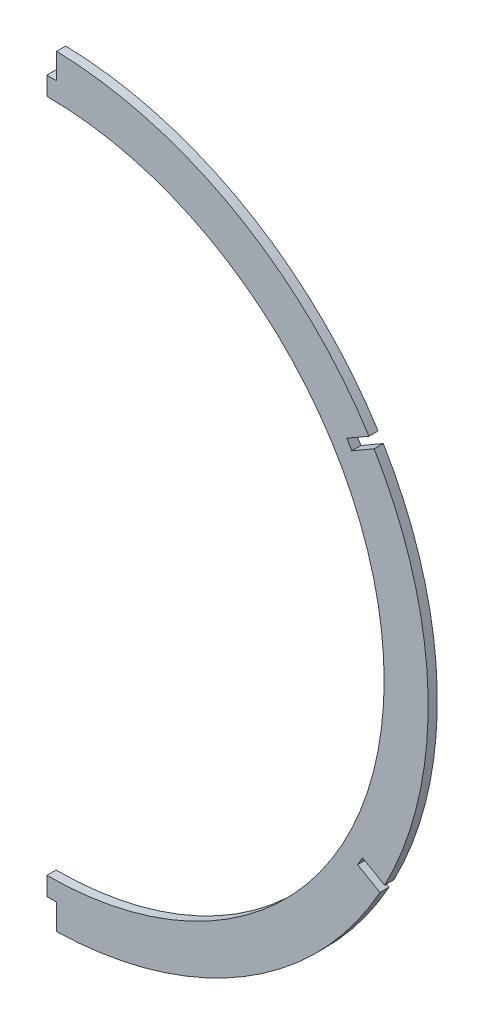
ISO-10303-21;
HEADER;
FILE_DESCRIPTION(('STEP AP214'),'2;1');
FILE_NAME('part.step','',(''),(''),'','','');
FILE_SCHEMA(('AUTOMOTIVE_DESIGN { 1 0 10303 214 1 1 1 1 }'));
ENDSEC;
DATA;
#1=APPLICATION_CONTEXT('core data for automotive mechanical design processes');
#2=APPLICATION_PROTOCOL_DEFINITION('international standard','automotive_design',2000,#1);
#3=PRODUCT_CONTEXT('',#1,'mechanical');
#4=PRODUCT('Part','Part','',(#3));
#5=PRODUCT_RELATED_PRODUCT_CATEGORY('part','',(#4));
#6=PRODUCT_DEFINITION_FORMATION('','',#4);
#7=PRODUCT_DEFINITION_CONTEXT('part definition',#1,'design');
#8=PRODUCT_DEFINITION('design','',#6,#7);
#9=PRODUCT_DEFINITION_SHAPE('','',#8);
#10=(LENGTH_UNIT() NAMED_UNIT(*) SI_UNIT(.MILLI.,.METRE.));
#11=(NAMED_UNIT(*) PLANE_ANGLE_UNIT() SI_UNIT($,.RADIAN.));
#12=(NAMED_UNIT(*) SI_UNIT($,.STERADIAN.) SOLID_ANGLE_UNIT());
#13=UNCERTAINTY_MEASURE_WITH_UNIT(LENGTH_MEASURE(1.E-05),#10,'distance_accuracy_value','');
#14=(GEOMETRIC_REPRESENTATION_CONTEXT(3) GLOBAL_UNCERTAINTY_ASSIGNED_CONTEXT((#13)) GLOBAL_UNIT_ASSIGNED_CONTEXT((#10,
#11,#12)) REPRESENTATION_CONTEXT('',''));
#15=CARTESIAN_POINT('',(0.,0.,0.));
#16=DIRECTION('',(0.,0.,1.));
#17=DIRECTION('',(1.,0.,0.));
#18=AXIS2_PLACEMENT_3D('',#15,#16,#17);
#19=CARTESIAN_POINT('',(0.,-3.556,1.5875));
#20=DIRECTION('',(0.,0.,1.));
#21=DIRECTION('',(1.,0.,0.));
#22=AXIS2_PLACEMENT_3D('',#19,#20,#21);
#23=PLANE('',#22);
#24=DIRECTION('',(0.,1.,0.));
#25=VECTOR('',#24,1.);
#26=CARTESIAN_POINT('',(3.3782,0.,1.5875));
#27=LINE('',#26,#25);
#28=CARTESIAN_POINT('',(3.3782,119.634,1.5875));
#29=VERTEX_POINT('',#28);
#30=CARTESIAN_POINT('',(3.3782,128.480790951462,1.5875));
#31=VERTEX_POINT('',#30);
#32=EDGE_CURVE('E172',#29,#31,#27,.T.);
#33=ORIENTED_EDGE('',*,*,#32,.F.);
#34=DIRECTION('',(-1.,0.,0.));
#35=VECTOR('',#34,1.);
#36=CARTESIAN_POINT('',(0.,119.634,1.5875));
#37=LINE('',#36,#35);
#38=CARTESIAN_POINT('',(0.,119.634,1.5875));
#39=VERTEX_POINT('',#38);
#40=EDGE_CURVE('E155',#29,#39,#37,.T.);
#41=ORIENTED_EDGE('',*,*,#40,.T.);
#42=DIRECTION('',(0.,1.,0.));
#43=VECTOR('',#42,1.);
#44=CARTESIAN_POINT('',(0.,-3.556,1.5875));
#45=LINE('',#44,#43);
#46=CARTESIAN_POINT('',(0.,113.284,1.5875));
#47=VERTEX_POINT('',#46);
#48=EDGE_CURVE('E244',#47,#39,#45,.T.);
#49=ORIENTED_EDGE('',*,*,#48,.F.);
#50=CARTESIAN_POINT('',(0.,-3.556,1.5875));
#51=DIRECTION('',(0.,0.,1.));
#52=DIRECTION('',(1.,0.,0.));
#53=AXIS2_PLACEMENT_3D('',#50,#51,#52);
#54=CIRCLE('',#53,116.84);
#55=CARTESIAN_POINT('',(0.,-120.396,1.5875));
#56=VERTEX_POINT('',#55);
#57=EDGE_CURVE('E249',#56,#47,#54,.T.);
#58=ORIENTED_EDGE('',*,*,#57,.F.);
#59=CARTESIAN_POINT('',(0.,-126.746,1.5875));
#60=VERTEX_POINT('',#59);
#61=EDGE_CURVE('E248',#60,#56,#45,.T.);
#62=ORIENTED_EDGE('',*,*,#61,.F.);
#63=DIRECTION('',(-1.,0.,0.));
#64=VECTOR('',#63,1.);
#65=CARTESIAN_POINT('',(0.,-126.746,1.5875));
#66=LINE('',#65,#64);
#67=CARTESIAN_POINT('',(3.3782,-126.746,1.5875));
#68=VERTEX_POINT('',#67);
#69=EDGE_CURVE('E230',#68,#60,#66,.T.);
#70=ORIENTED_EDGE('',*,*,#69,.F.);
#71=DIRECTION('',(0.,-1.,0.));
#72=VECTOR('',#71,1.);
#73=CARTESIAN_POINT('',(3.3782,0.,1.5875));
#74=LINE('',#73,#72);
#75=CARTESIAN_POINT('',(3.3782,-135.592790951462,1.5875));
#76=VERTEX_POINT('',#75);
#77=EDGE_CURVE('E234',#68,#76,#74,.T.);
#78=ORIENTED_EDGE('',*,*,#77,.T.);
#79=CARTESIAN_POINT('',(0.,-3.556,1.5875));
#80=DIRECTION('',(0.,0.,1.));
#81=DIRECTION('',(1.,0.,0.));
#82=AXIS2_PLACEMENT_3D('',#79,#80,#81);
#83=CIRCLE('',#82,132.08);
#84=CARTESIAN_POINT('',(115.385044136038,-67.8321074562272,1.5875));
#85=VERTEX_POINT('',#84);
#86=EDGE_CURVE('E260',#76,#85,#83,.T.);
#87=ORIENTED_EDGE('',*,*,#86,.T.);
#88=DIRECTION('',(0.866025403784438,-0.500000000000001,0.));
#89=VECTOR('',#88,1.);
#90=CARTESIAN_POINT('',(-0.525903090654587,-0.910890872871243,1.5875));
#91=LINE('',#90,#89);
#92=CARTESIAN_POINT('',(107.648347052546,-63.3653233124345,1.5875));
#93=VERTEX_POINT('',#92);
#94=EDGE_CURVE('E59',#93,#85,#91,.T.);
#95=ORIENTED_EDGE('',*,*,#94,.F.);
#96=DIRECTION('',(0.500000000000001,0.866025403784438,0.));
#97=VECTOR('',#96,1.);
#98=CARTESIAN_POINT('',(108.174250143201,-62.4544324395632,1.5875));
#99=LINE('',#98,#97);
#100=CARTESIAN_POINT('',(109.337447052546,-60.4397162933699,1.5875));
#101=VERTEX_POINT('',#100);
#102=EDGE_CURVE('E213',#93,#101,#99,.T.);
#103=ORIENTED_EDGE('',*,*,#102,.T.);
#104=DIRECTION('',(0.866025403784439,-0.5,0.));
#105=VECTOR('',#104,1.);
#106=CARTESIAN_POINT('',(1.16319690934529,2.01471614619314,1.5875));
#107=LINE('',#106,#105);
#108=CARTESIAN_POINT('',(116.991774889811,-64.8589445306805,1.5875));
#109=VERTEX_POINT('',#108);
#110=EDGE_CURVE('E207',#101,#109,#107,.T.);
#111=ORIENTED_EDGE('',*,*,#110,.T.);
#112=CARTESIAN_POINT('',(113.35726398149,64.2323257104845,1.5875));
#113=VERTEX_POINT('',#112);
#114=EDGE_CURVE('E258',#109,#113,#83,.T.);
#115=ORIENTED_EDGE('',*,*,#114,.T.);
#116=DIRECTION('',(0.866025403784438,0.500000000000001,0.));
#117=VECTOR('',#116,1.);
#118=CARTESIAN_POINT('',(0.525903090654673,-0.910890872871393,1.5875));
#119=LINE('',#118,#117);
#120=CARTESIAN_POINT('',(105.620566897998,59.7655415666918,1.5875));
#121=VERTEX_POINT('',#120);
#122=EDGE_CURVE('E51',#121,#113,#119,.T.);
#123=ORIENTED_EDGE('',*,*,#122,.F.);
#124=DIRECTION('',(-0.500000000000002,0.866025403784438,0.));
#125=VECTOR('',#124,1.);
#126=CARTESIAN_POINT('',(105.094663807344,60.6764324395633,1.5875));
#127=LINE('',#126,#125);
#128=CARTESIAN_POINT('',(103.931466897998,62.6911485857563,1.5875));
#129=VERTEX_POINT('',#128);
#130=EDGE_CURVE('E190',#121,#129,#127,.T.);
#131=ORIENTED_EDGE('',*,*,#130,.T.);
#132=DIRECTION('',(0.866025403784439,0.499999999999999,0.));
#133=VECTOR('',#132,1.);
#134=CARTESIAN_POINT('',(-1.1631969093454,2.01471614619333,1.5875));
#135=LINE('',#134,#133);
#136=CARTESIAN_POINT('',(111.585794735263,67.1103768230669,1.5875));
#137=VERTEX_POINT('',#136);
#138=EDGE_CURVE('E184',#129,#137,#135,.T.);
#139=ORIENTED_EDGE('',*,*,#138,.T.);
#140=EDGE_CURVE('E255',#137,#31,#83,.T.);
#141=ORIENTED_EDGE('',*,*,#140,.T.);
#142=EDGE_LOOP('',(#33,#41,#49,#58,#62,#70,#78,#87,#95,#103,#111,#115,#123,#131,#139,#141));
#143=FACE_BOUND('',#142,.T.);
#144=ADVANCED_FACE('F36',(#143),#23,.T.);
#145=CARTESIAN_POINT('',(0.,-3.556,-1.5875));
#146=DIRECTION('',(0.,0.,1.));
#147=DIRECTION('',(1.,0.,0.));
#148=AXIS2_PLACEMENT_3D('',#145,#146,#147);
#149=PLANE('',#148);
#150=DIRECTION('',(-1.,0.,0.));
#151=VECTOR('',#150,1.);
#152=CARTESIAN_POINT('',(0.,119.634,-1.5875));
#153=LINE('',#152,#151);
#154=CARTESIAN_POINT('',(3.3782,119.634,-1.5875));
#155=VERTEX_POINT('',#154);
#156=CARTESIAN_POINT('',(0.,119.634,-1.5875));
#157=VERTEX_POINT('',#156);
#158=EDGE_CURVE('E152',#155,#157,#153,.T.);
#159=ORIENTED_EDGE('',*,*,#158,.F.);
#160=DIRECTION('',(0.,1.,0.));
#161=VECTOR('',#160,1.);
#162=CARTESIAN_POINT('',(3.3782,0.,-1.5875));
#163=LINE('',#162,#161);
#164=CARTESIAN_POINT('',(3.3782,128.480790951462,-1.5875));
#165=VERTEX_POINT('',#164);
#166=EDGE_CURVE('E159',#155,#165,#163,.T.);
#167=ORIENTED_EDGE('',*,*,#166,.T.);
#168=CARTESIAN_POINT('',(0.,-3.556,-1.5875));
#169=DIRECTION('',(0.,0.,1.));
#170=DIRECTION('',(1.,0.,0.));
#171=AXIS2_PLACEMENT_3D('',#168,#169,#170);
#172=CIRCLE('',#171,132.08);
#173=CARTESIAN_POINT('',(111.585794735263,67.1103768230669,-1.5875));
#174=VERTEX_POINT('',#173);
#175=EDGE_CURVE('E252',#174,#165,#172,.T.);
#176=ORIENTED_EDGE('',*,*,#175,.F.);
#177=DIRECTION('',(0.866025403784439,0.499999999999999,0.));
#178=VECTOR('',#177,1.);
#179=CARTESIAN_POINT('',(-1.1631969093454,2.01471614619333,-1.5875));
#180=LINE('',#179,#178);
#181=CARTESIAN_POINT('',(103.931466897998,62.6911485857563,-1.5875));
#182=VERTEX_POINT('',#181);
#183=EDGE_CURVE('E187',#182,#174,#180,.T.);
#184=ORIENTED_EDGE('',*,*,#183,.F.);
#185=DIRECTION('',(-0.500000000000002,0.866025403784438,0.));
#186=VECTOR('',#185,1.);
#187=CARTESIAN_POINT('',(105.094663807344,60.6764324395633,-1.5875));
#188=LINE('',#187,#186);
#189=CARTESIAN_POINT('',(105.620566897998,59.7655415666918,-1.5875));
#190=VERTEX_POINT('',#189);
#191=EDGE_CURVE('E181',#190,#182,#188,.T.);
#192=ORIENTED_EDGE('',*,*,#191,.F.);
#193=DIRECTION('',(0.866025403784438,0.500000000000001,0.));
#194=VECTOR('',#193,1.);
#195=CARTESIAN_POINT('',(0.525903090654673,-0.910890872871393,-1.5875));
#196=LINE('',#195,#194);
#197=CARTESIAN_POINT('',(113.35726398149,64.2323257104845,-1.5875));
#198=VERTEX_POINT('',#197);
#199=EDGE_CURVE('E183',#190,#198,#196,.T.);
#200=ORIENTED_EDGE('',*,*,#199,.T.);
#201=CARTESIAN_POINT('',(116.991774889811,-64.8589445306805,-1.5875));
#202=VERTEX_POINT('',#201);
#203=EDGE_CURVE('E261',#202,#198,#172,.T.);
#204=ORIENTED_EDGE('',*,*,#203,.F.);
#205=DIRECTION('',(0.866025403784439,-0.5,0.));
#206=VECTOR('',#205,1.);
#207=CARTESIAN_POINT('',(1.16319690934529,2.01471614619314,-1.5875));
#208=LINE('',#207,#206);
#209=CARTESIAN_POINT('',(109.337447052546,-60.4397162933699,-1.5875));
#210=VERTEX_POINT('',#209);
#211=EDGE_CURVE('E210',#210,#202,#208,.T.);
#212=ORIENTED_EDGE('',*,*,#211,.F.);
#213=DIRECTION('',(0.500000000000001,0.866025403784438,0.));
#214=VECTOR('',#213,1.);
#215=CARTESIAN_POINT('',(108.174250143201,-62.4544324395632,-1.5875));
#216=LINE('',#215,#214);
#217=CARTESIAN_POINT('',(107.648347052546,-63.3653233124345,-1.5875));
#218=VERTEX_POINT('',#217);
#219=EDGE_CURVE('E204',#218,#210,#216,.T.);
#220=ORIENTED_EDGE('',*,*,#219,.F.);
#221=DIRECTION('',(0.866025403784438,-0.500000000000001,0.));
#222=VECTOR('',#221,1.);
#223=CARTESIAN_POINT('',(-0.525903090654587,-0.910890872871243,-1.5875));
#224=LINE('',#223,#222);
#225=CARTESIAN_POINT('',(115.385044136038,-67.8321074562272,-1.5875));
#226=VERTEX_POINT('',#225);
#227=EDGE_CURVE('E206',#218,#226,#224,.T.);
#228=ORIENTED_EDGE('',*,*,#227,.T.);
#229=CARTESIAN_POINT('',(3.3782,-135.592790951462,-1.5875));
#230=VERTEX_POINT('',#229);
#231=EDGE_CURVE('E259',#230,#226,#172,.T.);
#232=ORIENTED_EDGE('',*,*,#231,.F.);
#233=DIRECTION('',(0.,-1.,0.));
#234=VECTOR('',#233,1.);
#235=CARTESIAN_POINT('',(3.3782,0.,-1.5875));
#236=LINE('',#235,#234);
#237=CARTESIAN_POINT('',(3.3782,-126.746,-1.5875));
#238=VERTEX_POINT('',#237);
#239=EDGE_CURVE('E227',#238,#230,#236,.T.);
#240=ORIENTED_EDGE('',*,*,#239,.F.);
#241=DIRECTION('',(-1.,0.,0.));
#242=VECTOR('',#241,1.);
#243=CARTESIAN_POINT('',(0.,-126.746,-1.5875));
#244=LINE('',#243,#242);
#245=CARTESIAN_POINT('',(0.,-126.746,-1.5875));
#246=VERTEX_POINT('',#245);
#247=EDGE_CURVE('E229',#238,#246,#244,.T.);
#248=ORIENTED_EDGE('',*,*,#247,.T.);
#249=DIRECTION('',(0.,1.,0.));
#250=VECTOR('',#249,1.);
#251=CARTESIAN_POINT('',(0.,-3.556,-1.5875));
#252=LINE('',#251,#250);
#253=CARTESIAN_POINT('',(0.,-120.396,-1.5875));
#254=VERTEX_POINT('',#253);
#255=EDGE_CURVE('E245',#246,#254,#252,.T.);
#256=ORIENTED_EDGE('',*,*,#255,.T.);
#257=CARTESIAN_POINT('',(0.,-3.556,-1.5875));
#258=DIRECTION('',(0.,0.,1.));
#259=DIRECTION('',(1.,0.,0.));
#260=AXIS2_PLACEMENT_3D('',#257,#258,#259);
#261=CIRCLE('',#260,116.84);
#262=CARTESIAN_POINT('',(0.,113.284,-1.5875));
#263=VERTEX_POINT('',#262);
#264=EDGE_CURVE('E253',#254,#263,#261,.T.);
#265=ORIENTED_EDGE('',*,*,#264,.T.);
#266=EDGE_CURVE('E171',#263,#157,#252,.T.);
#267=ORIENTED_EDGE('',*,*,#266,.T.);
#268=EDGE_LOOP('',(#159,#167,#176,#184,#192,#200,#204,#212,#220,#228,#232,#240,#248,#256,#265,#267));
#269=FACE_BOUND('',#268,.T.);
#270=ADVANCED_FACE('F169',(#269),#149,.F.);
#271=CARTESIAN_POINT('',(0.,-3.556,1.5875));
#272=DIRECTION('',(0.,0.,-1.));
#273=DIRECTION('',(-1.,0.,0.));
#274=AXIS2_PLACEMENT_3D('',#271,#272,#273);
#275=CYLINDRICAL_SURFACE('',#274,132.08);
#276=ORIENTED_EDGE('',*,*,#175,.T.);
#277=DIRECTION('',(0.,0.,1.));
#278=VECTOR('',#277,1.);
#279=CARTESIAN_POINT('',(3.3782,128.480790951462,-1.5875));
#280=LINE('',#279,#278);
#281=EDGE_CURVE('E158',#165,#31,#280,.T.);
#282=ORIENTED_EDGE('',*,*,#281,.T.);
#283=ORIENTED_EDGE('',*,*,#140,.F.);
#284=DIRECTION('',(0.,0.,1.));
#285=VECTOR('',#284,1.);
#286=CARTESIAN_POINT('',(111.585794735263,67.1103768230669,-1.5875));
#287=LINE('',#286,#285);
#288=EDGE_CURVE('E199',#174,#137,#287,.T.);
#289=ORIENTED_EDGE('',*,*,#288,.F.);
#290=EDGE_LOOP('',(#276,#282,#283,#289));
#291=FACE_BOUND('',#290,.T.);
#292=ADVANCED_FACE('F38',(#291),#275,.T.);
#293=ORIENTED_EDGE('',*,*,#203,.T.);
#294=DIRECTION('',(0.,0.,1.));
#295=VECTOR('',#294,1.);
#296=CARTESIAN_POINT('',(113.35726398149,64.2323257104845,-1.5875));
#297=LINE('',#296,#295);
#298=EDGE_CURVE('E201',#198,#113,#297,.T.);
#299=ORIENTED_EDGE('',*,*,#298,.T.);
#300=ORIENTED_EDGE('',*,*,#114,.F.);
#301=DIRECTION('',(0.,0.,1.));
#302=VECTOR('',#301,1.);
#303=CARTESIAN_POINT('',(116.991774889811,-64.8589445306805,-1.5875));
#304=LINE('',#303,#302);
#305=EDGE_CURVE('E222',#202,#109,#304,.T.);
#306=ORIENTED_EDGE('',*,*,#305,.F.);
#307=EDGE_LOOP('',(#293,#299,#300,#306));
#308=FACE_BOUND('',#307,.T.);
#309=ADVANCED_FACE('F273',(#308),#275,.T.);
#310=ORIENTED_EDGE('',*,*,#231,.T.);
#311=DIRECTION('',(0.,0.,1.));
#312=VECTOR('',#311,1.);
#313=CARTESIAN_POINT('',(115.385044136038,-67.8321074562272,-1.5875));
#314=LINE('',#313,#312);
#315=EDGE_CURVE('E224',#226,#85,#314,.T.);
#316=ORIENTED_EDGE('',*,*,#315,.T.);
#317=ORIENTED_EDGE('',*,*,#86,.F.);
#318=DIRECTION('',(0.,0.,1.));
#319=VECTOR('',#318,1.);
#320=CARTESIAN_POINT('',(3.3782,-135.592790951462,-1.5875));
#321=LINE('',#320,#319);
#322=EDGE_CURVE('E216',#230,#76,#321,.T.);
#323=ORIENTED_EDGE('',*,*,#322,.F.);
#324=EDGE_LOOP('',(#310,#316,#317,#323));
#325=FACE_BOUND('',#324,.T.);
#326=ADVANCED_FACE('F290',(#325),#275,.T.);
#327=CARTESIAN_POINT('',(0.,0.,0.));
#328=DIRECTION('',(1.,0.,0.));
#329=DIRECTION('',(0.,0.,-1.));
#330=AXIS2_PLACEMENT_3D('',#327,#328,#329);
#331=PLANE('',#330);
#332=DIRECTION('',(0.,0.,1.));
#333=VECTOR('',#332,1.);
#334=CARTESIAN_POINT('',(0.,119.634,-1.5875));
#335=LINE('',#334,#333);
#336=EDGE_CURVE('E178',#157,#39,#335,.T.);
#337=ORIENTED_EDGE('',*,*,#336,.F.);
#338=ORIENTED_EDGE('',*,*,#266,.F.);
#339=DIRECTION('',(0.,0.,-1.));
#340=VECTOR('',#339,1.);
#341=CARTESIAN_POINT('',(0.,113.284,1.5875));
#342=LINE('',#341,#340);
#343=EDGE_CURVE('E44',#263,#47,#342,.F.);
#344=ORIENTED_EDGE('',*,*,#343,.T.);
#345=ORIENTED_EDGE('',*,*,#48,.T.);
#346=EDGE_LOOP('',(#337,#338,#344,#345));
#347=FACE_BOUND('',#346,.T.);
#348=ADVANCED_FACE('F296',(#347),#331,.F.);
#349=CARTESIAN_POINT('',(0.,-3.556,1.5875));
#350=DIRECTION('',(0.,0.,-1.));
#351=DIRECTION('',(-1.,0.,0.));
#352=AXIS2_PLACEMENT_3D('',#349,#350,#351);
#353=CYLINDRICAL_SURFACE('',#352,116.84);
#354=DIRECTION('',(0.,0.,-1.));
#355=VECTOR('',#354,1.);
#356=CARTESIAN_POINT('',(0.,-120.396,1.5875));
#357=LINE('',#356,#355);
#358=EDGE_CURVE('E11',#56,#254,#357,.T.);
#359=ORIENTED_EDGE('',*,*,#358,.F.);
#360=ORIENTED_EDGE('',*,*,#57,.T.);
#361=ORIENTED_EDGE('',*,*,#343,.F.);
#362=ORIENTED_EDGE('',*,*,#264,.F.);
#363=EDGE_LOOP('',(#359,#360,#361,#362));
#364=FACE_BOUND('',#363,.T.);
#365=ADVANCED_FACE('F303',(#364),#353,.F.);
#366=ORIENTED_EDGE('',*,*,#255,.F.);
#367=DIRECTION('',(0.,0.,1.));
#368=VECTOR('',#367,1.);
#369=CARTESIAN_POINT('',(0.,-126.746,-1.5875));
#370=LINE('',#369,#368);
#371=EDGE_CURVE('E239',#246,#60,#370,.T.);
#372=ORIENTED_EDGE('',*,*,#371,.T.);
#373=ORIENTED_EDGE('',*,*,#61,.T.);
#374=ORIENTED_EDGE('',*,*,#358,.T.);
#375=EDGE_LOOP('',(#366,#372,#373,#374));
#376=FACE_BOUND('',#375,.T.);
#377=ADVANCED_FACE('F306',(#376),#331,.F.);
#378=CARTESIAN_POINT('',(3.3782,0.,-1.5875));
#379=DIRECTION('',(-1.,0.,0.));
#380=DIRECTION('',(0.,0.,1.));
#381=AXIS2_PLACEMENT_3D('',#378,#379,#380);
#382=PLANE('',#381);
#383=ORIENTED_EDGE('',*,*,#77,.F.);
#384=DIRECTION('',(0.,0.,1.));
#385=VECTOR('',#384,1.);
#386=CARTESIAN_POINT('',(3.3782,-126.746,-1.5875));
#387=LINE('',#386,#385);
#388=EDGE_CURVE('E233',#238,#68,#387,.T.);
#389=ORIENTED_EDGE('',*,*,#388,.F.);
#390=ORIENTED_EDGE('',*,*,#239,.T.);
#391=ORIENTED_EDGE('',*,*,#322,.T.);
#392=EDGE_LOOP('',(#383,#389,#390,#391));
#393=FACE_BOUND('',#392,.T.);
#394=ADVANCED_FACE('F310',(#393),#382,.T.);
#395=CARTESIAN_POINT('',(0.,-126.746,-1.5875));
#396=DIRECTION('',(0.,1.,0.));
#397=DIRECTION('',(0.,0.,1.));
#398=AXIS2_PLACEMENT_3D('',#395,#396,#397);
#399=PLANE('',#398);
#400=ORIENTED_EDGE('',*,*,#69,.T.);
#401=ORIENTED_EDGE('',*,*,#371,.F.);
#402=ORIENTED_EDGE('',*,*,#247,.F.);
#403=ORIENTED_EDGE('',*,*,#388,.T.);
#404=EDGE_LOOP('',(#400,#401,#402,#403));
#405=FACE_BOUND('',#404,.T.);
#406=ADVANCED_FACE('F314',(#405),#399,.F.);
#407=CARTESIAN_POINT('',(0.,119.634,-1.5875));
#408=DIRECTION('',(0.,1.,0.));
#409=DIRECTION('',(0.,0.,1.));
#410=AXIS2_PLACEMENT_3D('',#407,#408,#409);
#411=PLANE('',#410);
#412=ORIENTED_EDGE('',*,*,#40,.F.);
#413=DIRECTION('',(0.,0.,1.));
#414=VECTOR('',#413,1.);
#415=CARTESIAN_POINT('',(3.3782,119.634,-1.5875));
#416=LINE('',#415,#414);
#417=EDGE_CURVE('E148',#155,#29,#416,.T.);
#418=ORIENTED_EDGE('',*,*,#417,.F.);
#419=ORIENTED_EDGE('',*,*,#158,.T.);
#420=ORIENTED_EDGE('',*,*,#336,.T.);
#421=EDGE_LOOP('',(#412,#418,#419,#420));
#422=FACE_BOUND('',#421,.T.);
#423=ADVANCED_FACE('F150',(#422),#411,.T.);
#424=CARTESIAN_POINT('',(3.3782,0.,-1.5875));
#425=DIRECTION('',(1.,0.,0.));
#426=DIRECTION('',(0.,0.,-1.));
#427=AXIS2_PLACEMENT_3D('',#424,#425,#426);
#428=PLANE('',#427);
#429=ORIENTED_EDGE('',*,*,#32,.T.);
#430=ORIENTED_EDGE('',*,*,#281,.F.);
#431=ORIENTED_EDGE('',*,*,#166,.F.);
#432=ORIENTED_EDGE('',*,*,#417,.T.);
#433=EDGE_LOOP('',(#429,#430,#431,#432));
#434=FACE_BOUND('',#433,.T.);
#435=ADVANCED_FACE('F162',(#434),#428,.F.);
#436=CARTESIAN_POINT('',(108.174250143201,-62.4544324395632,-1.5875));
#437=DIRECTION('',(0.866025403784438,-0.500000000000001,0.));
#438=DIRECTION('',(0.500000000000001,0.866025403784438,0.));
#439=AXIS2_PLACEMENT_3D('',#436,#437,#438);
#440=PLANE('',#439);
#441=ORIENTED_EDGE('',*,*,#102,.F.);
#442=DIRECTION('',(0.,0.,1.));
#443=VECTOR('',#442,1.);
#444=CARTESIAN_POINT('',(107.648347052546,-63.3653233124345,-1.5875));
#445=LINE('',#444,#443);
#446=EDGE_CURVE('E212',#218,#93,#445,.T.);
#447=ORIENTED_EDGE('',*,*,#446,.F.);
#448=ORIENTED_EDGE('',*,*,#219,.T.);
#449=DIRECTION('',(0.,0.,1.));
#450=VECTOR('',#449,1.);
#451=CARTESIAN_POINT('',(109.337447052546,-60.4397162933699,-1.5875));
#452=LINE('',#451,#450);
#453=EDGE_CURVE('E193',#210,#101,#452,.T.);
#454=ORIENTED_EDGE('',*,*,#453,.T.);
#455=EDGE_LOOP('',(#441,#447,#448,#454));
#456=FACE_BOUND('',#455,.T.);
#457=ADVANCED_FACE('F319',(#456),#440,.T.);
#458=CARTESIAN_POINT('',(1.16319690934529,2.01471614619314,-1.5875));
#459=DIRECTION('',(-0.5,-0.866025403784439,0.));
#460=DIRECTION('',(0.866025403784439,-0.5,0.));
#461=AXIS2_PLACEMENT_3D('',#458,#459,#460);
#462=PLANE('',#461);
#463=ORIENTED_EDGE('',*,*,#110,.F.);
#464=ORIENTED_EDGE('',*,*,#453,.F.);
#465=ORIENTED_EDGE('',*,*,#211,.T.);
#466=ORIENTED_EDGE('',*,*,#305,.T.);
#467=EDGE_LOOP('',(#463,#464,#465,#466));
#468=FACE_BOUND('',#467,.T.);
#469=ADVANCED_FACE('F322',(#468),#462,.T.);
#470=CARTESIAN_POINT('',(-0.525903090654587,-0.910890872871243,-1.5875));
#471=DIRECTION('',(-0.500000000000001,-0.866025403784438,0.));
#472=DIRECTION('',(0.866025403784438,-0.500000000000001,0.));
#473=AXIS2_PLACEMENT_3D('',#470,#471,#472);
#474=PLANE('',#473);
#475=ORIENTED_EDGE('',*,*,#94,.T.);
#476=ORIENTED_EDGE('',*,*,#315,.F.);
#477=ORIENTED_EDGE('',*,*,#227,.F.);
#478=ORIENTED_EDGE('',*,*,#446,.T.);
#479=EDGE_LOOP('',(#475,#476,#477,#478));
#480=FACE_BOUND('',#479,.T.);
#481=ADVANCED_FACE('F324',(#480),#474,.F.);
#482=CARTESIAN_POINT('',(105.094663807344,60.6764324395633,-1.5875));
#483=DIRECTION('',(0.866025403784437,0.500000000000002,0.));
#484=DIRECTION('',(-0.500000000000002,0.866025403784437,0.));
#485=AXIS2_PLACEMENT_3D('',#482,#483,#484);
#486=PLANE('',#485);
#487=ORIENTED_EDGE('',*,*,#130,.F.);
#488=DIRECTION('',(0.,0.,1.));
#489=VECTOR('',#488,1.);
#490=CARTESIAN_POINT('',(105.620566897998,59.7655415666918,-1.5875));
#491=LINE('',#490,#489);
#492=EDGE_CURVE('E189',#190,#121,#491,.T.);
#493=ORIENTED_EDGE('',*,*,#492,.F.);
#494=ORIENTED_EDGE('',*,*,#191,.T.);
#495=DIRECTION('',(0.,0.,1.));
#496=VECTOR('',#495,1.);
#497=CARTESIAN_POINT('',(103.931466897998,62.6911485857563,-1.5875));
#498=LINE('',#497,#496);
#499=EDGE_CURVE('E176',#182,#129,#498,.T.);
#500=ORIENTED_EDGE('',*,*,#499,.T.);
#501=EDGE_LOOP('',(#487,#493,#494,#500));
#502=FACE_BOUND('',#501,.T.);
#503=ADVANCED_FACE('F283',(#502),#486,.T.);
#504=CARTESIAN_POINT('',(-1.1631969093454,2.01471614619333,-1.5875));
#505=DIRECTION('',(0.499999999999999,-0.866025403784439,0.));
#506=DIRECTION('',(0.866025403784439,0.499999999999999,0.));
#507=AXIS2_PLACEMENT_3D('',#504,#505,#506);
#508=PLANE('',#507);
#509=ORIENTED_EDGE('',*,*,#138,.F.);
#510=ORIENTED_EDGE('',*,*,#499,.F.);
#511=ORIENTED_EDGE('',*,*,#183,.T.);
#512=ORIENTED_EDGE('',*,*,#288,.T.);
#513=EDGE_LOOP('',(#509,#510,#511,#512));
#514=FACE_BOUND('',#513,.T.);
#515=ADVANCED_FACE('F285',(#514),#508,.T.);
#516=CARTESIAN_POINT('',(0.525903090654673,-0.910890872871393,-1.5875));
#517=DIRECTION('',(0.500000000000001,-0.866025403784438,0.));
#518=DIRECTION('',(0.866025403784438,0.500000000000001,0.));
#519=AXIS2_PLACEMENT_3D('',#516,#517,#518);
#520=PLANE('',#519);
#521=ORIENTED_EDGE('',*,*,#122,.T.);
#522=ORIENTED_EDGE('',*,*,#298,.F.);
#523=ORIENTED_EDGE('',*,*,#199,.F.);
#524=ORIENTED_EDGE('',*,*,#492,.T.);
#525=EDGE_LOOP('',(#521,#522,#523,#524));
#526=FACE_BOUND('',#525,.T.);
#527=ADVANCED_FACE('F276',(#526),#520,.F.);
#528=CLOSED_SHELL('',(#144,#270,#292,#309,#326,#348,#365,#377,#394,#406,#423,#435,#457,#469,
#481,#503,#515,#527));
#529=MANIFOLD_SOLID_BREP('B2',#528);
#530=ADVANCED_BREP_SHAPE_REPRESENTATION('',(#18,#529),#14);
#531=SHAPE_DEFINITION_REPRESENTATION(#9,#530);
ENDSEC;
END-ISO-10303-21;
